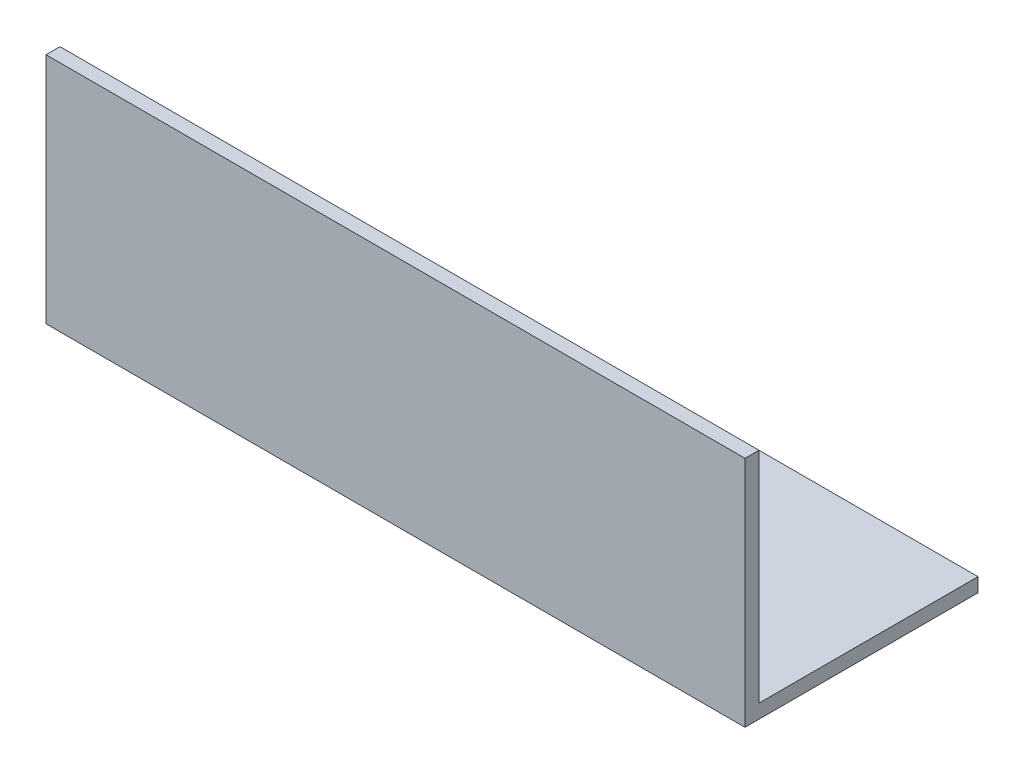
ISO-10303-21;
HEADER;
FILE_DESCRIPTION(('STEP AP214'),'2;1');
FILE_NAME('part.step','',(''),(''),'','','');
FILE_SCHEMA(('AUTOMOTIVE_DESIGN { 1 0 10303 214 1 1 1 1 }'));
ENDSEC;
DATA;
#1=APPLICATION_CONTEXT('core data for automotive mechanical design processes');
#2=APPLICATION_PROTOCOL_DEFINITION('international standard','automotive_design',2000,#1);
#3=PRODUCT_CONTEXT('',#1,'mechanical');
#4=PRODUCT('Part','Part','',(#3));
#5=PRODUCT_RELATED_PRODUCT_CATEGORY('part','',(#4));
#6=PRODUCT_DEFINITION_FORMATION('','',#4);
#7=PRODUCT_DEFINITION_CONTEXT('part definition',#1,'design');
#8=PRODUCT_DEFINITION('design','',#6,#7);
#9=PRODUCT_DEFINITION_SHAPE('','',#8);
#10=(LENGTH_UNIT() NAMED_UNIT(*) SI_UNIT(.MILLI.,.METRE.));
#11=(NAMED_UNIT(*) PLANE_ANGLE_UNIT() SI_UNIT($,.RADIAN.));
#12=(NAMED_UNIT(*) SI_UNIT($,.STERADIAN.) SOLID_ANGLE_UNIT());
#13=UNCERTAINTY_MEASURE_WITH_UNIT(LENGTH_MEASURE(1.E-05),#10,'distance_accuracy_value','');
#14=(GEOMETRIC_REPRESENTATION_CONTEXT(3) GLOBAL_UNCERTAINTY_ASSIGNED_CONTEXT((#13)) GLOBAL_UNIT_ASSIGNED_CONTEXT((#10,
#11,#12)) REPRESENTATION_CONTEXT('',''));
#15=CARTESIAN_POINT('',(0.,0.,0.));
#16=DIRECTION('',(0.,0.,1.));
#17=DIRECTION('',(1.,0.,0.));
#18=AXIS2_PLACEMENT_3D('',#15,#16,#17);
#19=CARTESIAN_POINT('',(76.2,0.,0.));
#20=DIRECTION('',(0.,1.,0.));
#21=DIRECTION('',(0.,0.,1.));
#22=AXIS2_PLACEMENT_3D('',#19,#20,#21);
#23=PLANE('',#22);
#24=DIRECTION('',(0.,0.,-1.));
#25=VECTOR('',#24,1.);
#26=CARTESIAN_POINT('',(0.,0.,0.));
#27=LINE('',#26,#25);
#28=CARTESIAN_POINT('',(0.,0.,0.));
#29=VERTEX_POINT('',#28);
#30=CARTESIAN_POINT('',(0.,0.,-25.4));
#31=VERTEX_POINT('',#30);
#32=EDGE_CURVE('E114',#29,#31,#27,.T.);
#33=ORIENTED_EDGE('',*,*,#32,.T.);
#34=DIRECTION('',(-1.,0.,0.));
#35=VECTOR('',#34,1.);
#36=CARTESIAN_POINT('',(76.2,0.,-25.4));
#37=LINE('',#36,#35);
#38=CARTESIAN_POINT('',(76.2,0.,-25.4));
#39=VERTEX_POINT('',#38);
#40=EDGE_CURVE('E11',#39,#31,#37,.T.);
#41=ORIENTED_EDGE('',*,*,#40,.F.);
#42=DIRECTION('',(0.,0.,-1.));
#43=VECTOR('',#42,1.);
#44=CARTESIAN_POINT('',(76.2,0.,0.));
#45=LINE('',#44,#43);
#46=CARTESIAN_POINT('',(76.2,0.,0.));
#47=VERTEX_POINT('',#46);
#48=EDGE_CURVE('E79',#47,#39,#45,.T.);
#49=ORIENTED_EDGE('',*,*,#48,.F.);
#50=DIRECTION('',(-1.,0.,0.));
#51=VECTOR('',#50,1.);
#52=CARTESIAN_POINT('',(76.2,0.,0.));
#53=LINE('',#52,#51);
#54=EDGE_CURVE('E110',#47,#29,#53,.T.);
#55=ORIENTED_EDGE('',*,*,#54,.T.);
#56=EDGE_LOOP('',(#33,#41,#49,#55));
#57=FACE_BOUND('',#56,.T.);
#58=ADVANCED_FACE('F33',(#57),#23,.F.);
#59=CARTESIAN_POINT('',(76.2,1.524,-25.4));
#60=DIRECTION('',(0.,0.,-1.));
#61=DIRECTION('',(-1.,0.,0.));
#62=AXIS2_PLACEMENT_3D('',#59,#60,#61);
#63=PLANE('',#62);
#64=DIRECTION('',(0.,-1.,0.));
#65=VECTOR('',#64,1.);
#66=CARTESIAN_POINT('',(0.,1.524,-25.4));
#67=LINE('',#66,#65);
#68=CARTESIAN_POINT('',(0.,1.524,-25.4));
#69=VERTEX_POINT('',#68);
#70=EDGE_CURVE('E117',#69,#31,#67,.T.);
#71=ORIENTED_EDGE('',*,*,#70,.F.);
#72=DIRECTION('',(-1.,0.,0.));
#73=VECTOR('',#72,1.);
#74=CARTESIAN_POINT('',(76.2,1.524,-25.4));
#75=LINE('',#74,#73);
#76=CARTESIAN_POINT('',(76.2,1.524,-25.4));
#77=VERTEX_POINT('',#76);
#78=EDGE_CURVE('E41',#77,#69,#75,.T.);
#79=ORIENTED_EDGE('',*,*,#78,.F.);
#80=DIRECTION('',(0.,-1.,0.));
#81=VECTOR('',#80,1.);
#82=CARTESIAN_POINT('',(76.2,1.524,-25.4));
#83=LINE('',#82,#81);
#84=EDGE_CURVE('E203',#77,#39,#83,.T.);
#85=ORIENTED_EDGE('',*,*,#84,.T.);
#86=ORIENTED_EDGE('',*,*,#40,.T.);
#87=EDGE_LOOP('',(#71,#79,#85,#86));
#88=FACE_BOUND('',#87,.T.);
#89=ADVANCED_FACE('F135',(#88),#63,.T.);
#90=CARTESIAN_POINT('',(76.2,1.524,0.));
#91=DIRECTION('',(0.,1.,0.));
#92=DIRECTION('',(0.,0.,1.));
#93=AXIS2_PLACEMENT_3D('',#90,#91,#92);
#94=PLANE('',#93);
#95=DIRECTION('',(0.,0.,-1.));
#96=VECTOR('',#95,1.);
#97=CARTESIAN_POINT('',(0.,1.524,0.));
#98=LINE('',#97,#96);
#99=CARTESIAN_POINT('',(0.,1.524,-1.524));
#100=VERTEX_POINT('',#99);
#101=EDGE_CURVE('E120',#100,#69,#98,.T.);
#102=ORIENTED_EDGE('',*,*,#101,.F.);
#103=DIRECTION('',(-1.,0.,0.));
#104=VECTOR('',#103,1.);
#105=CARTESIAN_POINT('',(76.2,1.524,-1.524));
#106=LINE('',#105,#104);
#107=CARTESIAN_POINT('',(76.2,1.524,-1.524));
#108=VERTEX_POINT('',#107);
#109=EDGE_CURVE('E100',#108,#100,#106,.T.);
#110=ORIENTED_EDGE('',*,*,#109,.F.);
#111=DIRECTION('',(0.,0.,-1.));
#112=VECTOR('',#111,1.);
#113=CARTESIAN_POINT('',(76.2,1.524,0.));
#114=LINE('',#113,#112);
#115=EDGE_CURVE('E106',#108,#77,#114,.T.);
#116=ORIENTED_EDGE('',*,*,#115,.T.);
#117=ORIENTED_EDGE('',*,*,#78,.T.);
#118=EDGE_LOOP('',(#102,#110,#116,#117));
#119=FACE_BOUND('',#118,.T.);
#120=ADVANCED_FACE('F132',(#119),#94,.T.);
#121=CARTESIAN_POINT('',(76.2,0.,-1.524));
#122=DIRECTION('',(0.,0.,-1.));
#123=DIRECTION('',(-1.,0.,0.));
#124=AXIS2_PLACEMENT_3D('',#121,#122,#123);
#125=PLANE('',#124);
#126=DIRECTION('',(0.,1.,0.));
#127=VECTOR('',#126,1.);
#128=CARTESIAN_POINT('',(0.,0.,-1.524));
#129=LINE('',#128,#127);
#130=CARTESIAN_POINT('',(0.,25.4,-1.524));
#131=VERTEX_POINT('',#130);
#132=EDGE_CURVE('E95',#131,#100,#129,.F.);
#133=ORIENTED_EDGE('',*,*,#132,.F.);
#134=DIRECTION('',(-1.,0.,0.));
#135=VECTOR('',#134,1.);
#136=CARTESIAN_POINT('',(76.2,25.4,-1.524));
#137=LINE('',#136,#135);
#138=CARTESIAN_POINT('',(76.2,25.4,-1.524));
#139=VERTEX_POINT('',#138);
#140=EDGE_CURVE('E90',#139,#131,#137,.T.);
#141=ORIENTED_EDGE('',*,*,#140,.F.);
#142=DIRECTION('',(0.,1.,0.));
#143=VECTOR('',#142,1.);
#144=CARTESIAN_POINT('',(76.2,0.,-1.524));
#145=LINE('',#144,#143);
#146=EDGE_CURVE('E93',#139,#108,#145,.F.);
#147=ORIENTED_EDGE('',*,*,#146,.T.);
#148=ORIENTED_EDGE('',*,*,#109,.T.);
#149=EDGE_LOOP('',(#133,#141,#147,#148));
#150=FACE_BOUND('',#149,.T.);
#151=ADVANCED_FACE('F92',(#150),#125,.T.);
#152=CARTESIAN_POINT('',(76.2,25.4,0.));
#153=DIRECTION('',(0.,1.,0.));
#154=DIRECTION('',(0.,0.,1.));
#155=AXIS2_PLACEMENT_3D('',#152,#153,#154);
#156=PLANE('',#155);
#157=DIRECTION('',(0.,0.,-1.));
#158=VECTOR('',#157,1.);
#159=CARTESIAN_POINT('',(0.,25.4,0.));
#160=LINE('',#159,#158);
#161=CARTESIAN_POINT('',(0.,25.4,0.));
#162=VERTEX_POINT('',#161);
#163=EDGE_CURVE('E124',#162,#131,#160,.T.);
#164=ORIENTED_EDGE('',*,*,#163,.F.);
#165=DIRECTION('',(-1.,0.,0.));
#166=VECTOR('',#165,1.);
#167=CARTESIAN_POINT('',(76.2,25.4,0.));
#168=LINE('',#167,#166);
#169=CARTESIAN_POINT('',(76.2,25.4,0.));
#170=VERTEX_POINT('',#169);
#171=EDGE_CURVE('E70',#170,#162,#168,.T.);
#172=ORIENTED_EDGE('',*,*,#171,.F.);
#173=DIRECTION('',(0.,0.,-1.));
#174=VECTOR('',#173,1.);
#175=CARTESIAN_POINT('',(76.2,25.4,0.));
#176=LINE('',#175,#174);
#177=EDGE_CURVE('E104',#170,#139,#176,.T.);
#178=ORIENTED_EDGE('',*,*,#177,.T.);
#179=ORIENTED_EDGE('',*,*,#140,.T.);
#180=EDGE_LOOP('',(#164,#172,#178,#179));
#181=FACE_BOUND('',#180,.T.);
#182=ADVANCED_FACE('F108',(#181),#156,.T.);
#183=CARTESIAN_POINT('',(76.2,0.,0.));
#184=DIRECTION('',(0.,0.,-1.));
#185=DIRECTION('',(-1.,0.,0.));
#186=AXIS2_PLACEMENT_3D('',#183,#184,#185);
#187=PLANE('',#186);
#188=DIRECTION('',(0.,-1.,0.));
#189=VECTOR('',#188,1.);
#190=CARTESIAN_POINT('',(0.,0.,0.));
#191=LINE('',#190,#189);
#192=EDGE_CURVE('E73',#162,#29,#191,.T.);
#193=ORIENTED_EDGE('',*,*,#192,.T.);
#194=ORIENTED_EDGE('',*,*,#54,.F.);
#195=DIRECTION('',(0.,-1.,0.));
#196=VECTOR('',#195,1.);
#197=CARTESIAN_POINT('',(76.2,0.,0.));
#198=LINE('',#197,#196);
#199=EDGE_CURVE('E49',#170,#47,#198,.T.);
#200=ORIENTED_EDGE('',*,*,#199,.F.);
#201=ORIENTED_EDGE('',*,*,#171,.T.);
#202=EDGE_LOOP('',(#193,#194,#200,#201));
#203=FACE_BOUND('',#202,.T.);
#204=ADVANCED_FACE('F140',(#203),#187,.F.);
#205=CARTESIAN_POINT('',(76.2,0.,0.));
#206=DIRECTION('',(-1.,0.,0.));
#207=DIRECTION('',(0.,0.,1.));
#208=AXIS2_PLACEMENT_3D('',#205,#206,#207);
#209=PLANE('',#208);
#210=ORIENTED_EDGE('',*,*,#48,.T.);
#211=ORIENTED_EDGE('',*,*,#84,.F.);
#212=ORIENTED_EDGE('',*,*,#115,.F.);
#213=ORIENTED_EDGE('',*,*,#146,.F.);
#214=ORIENTED_EDGE('',*,*,#177,.F.);
#215=ORIENTED_EDGE('',*,*,#199,.T.);
#216=EDGE_LOOP('',(#210,#211,#212,#213,#214,#215));
#217=FACE_BOUND('',#216,.T.);
#218=ADVANCED_FACE('F103',(#217),#209,.F.);
#219=CARTESIAN_POINT('',(0.,0.,0.));
#220=DIRECTION('',(-1.,0.,0.));
#221=DIRECTION('',(0.,0.,1.));
#222=AXIS2_PLACEMENT_3D('',#219,#220,#221);
#223=PLANE('',#222);
#224=ORIENTED_EDGE('',*,*,#32,.F.);
#225=ORIENTED_EDGE('',*,*,#192,.F.);
#226=ORIENTED_EDGE('',*,*,#163,.T.);
#227=ORIENTED_EDGE('',*,*,#132,.T.);
#228=ORIENTED_EDGE('',*,*,#101,.T.);
#229=ORIENTED_EDGE('',*,*,#70,.T.);
#230=EDGE_LOOP('',(#224,#225,#226,#227,#228,#229));
#231=FACE_BOUND('',#230,.T.);
#232=ADVANCED_FACE('F138',(#231),#223,.T.);
#233=CLOSED_SHELL('',(#58,#89,#120,#151,#182,#204,#218,#232));
#234=MANIFOLD_SOLID_BREP('B2',#233);
#235=ADVANCED_BREP_SHAPE_REPRESENTATION('',(#18,#234),#14);
#236=SHAPE_DEFINITION_REPRESENTATION(#9,#235);
ENDSEC;
END-ISO-10303-21;
